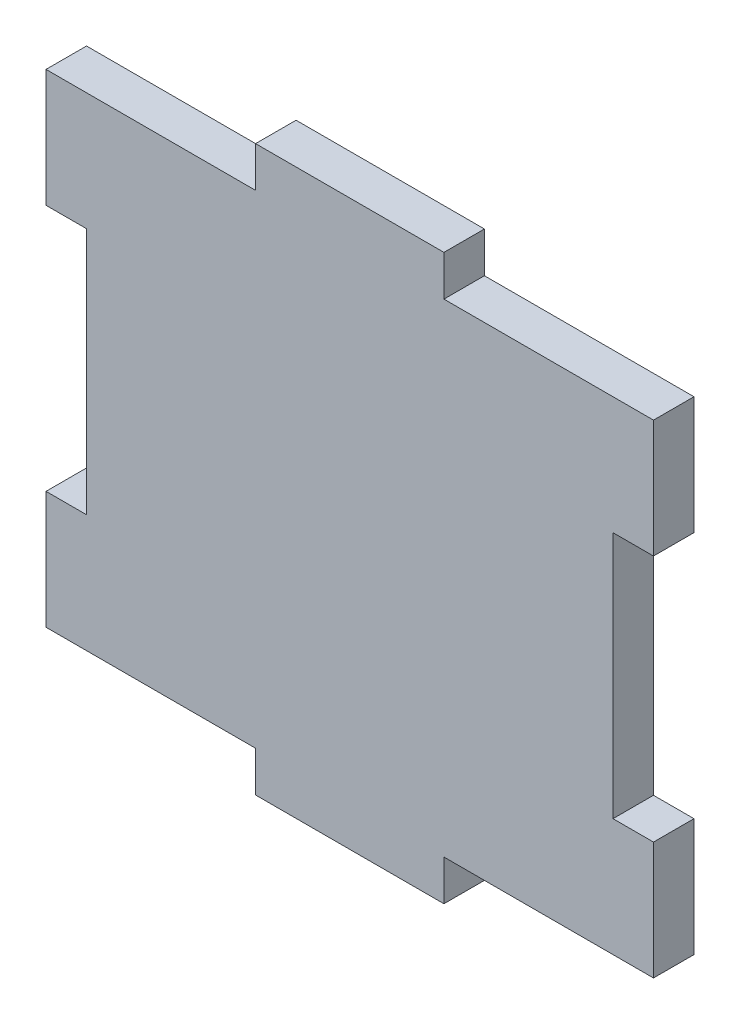
ISO-10303-21;
HEADER;
FILE_DESCRIPTION(('STEP AP214'),'2;1');
FILE_NAME('part.step','',(''),(''),'','','');
FILE_SCHEMA(('AUTOMOTIVE_DESIGN { 1 0 10303 214 1 1 1 1 }'));
ENDSEC;
DATA;
#1=APPLICATION_CONTEXT('core data for automotive mechanical design processes');
#2=APPLICATION_PROTOCOL_DEFINITION('international standard','automotive_design',2000,#1);
#3=PRODUCT_CONTEXT('',#1,'mechanical');
#4=PRODUCT('Part','Part','',(#3));
#5=PRODUCT_RELATED_PRODUCT_CATEGORY('part','',(#4));
#6=PRODUCT_DEFINITION_FORMATION('','',#4);
#7=PRODUCT_DEFINITION_CONTEXT('part definition',#1,'design');
#8=PRODUCT_DEFINITION('design','',#6,#7);
#9=PRODUCT_DEFINITION_SHAPE('','',#8);
#10=(LENGTH_UNIT() NAMED_UNIT(*) SI_UNIT(.MILLI.,.METRE.));
#11=(NAMED_UNIT(*) PLANE_ANGLE_UNIT() SI_UNIT($,.RADIAN.));
#12=(NAMED_UNIT(*) SI_UNIT($,.STERADIAN.) SOLID_ANGLE_UNIT());
#13=UNCERTAINTY_MEASURE_WITH_UNIT(LENGTH_MEASURE(1.E-05),#10,'distance_accuracy_value','');
#14=(GEOMETRIC_REPRESENTATION_CONTEXT(3) GLOBAL_UNCERTAINTY_ASSIGNED_CONTEXT((#13)) GLOBAL_UNIT_ASSIGNED_CONTEXT((#10,
#11,#12)) REPRESENTATION_CONTEXT('',''));
#15=CARTESIAN_POINT('',(0.,0.,0.));
#16=DIRECTION('',(0.,0.,1.));
#17=DIRECTION('',(1.,0.,0.));
#18=AXIS2_PLACEMENT_3D('',#15,#16,#17);
#19=CARTESIAN_POINT('',(-40.9575,-32.5755,5.461));
#20=DIRECTION('',(0.,1.,0.));
#21=DIRECTION('',(0.,0.,1.));
#22=AXIS2_PLACEMENT_3D('',#19,#20,#21);
#23=PLANE('',#22);
#24=DIRECTION('',(0.,0.,-1.));
#25=VECTOR('',#24,1.);
#26=CARTESIAN_POINT('',(-12.7,-32.5755,31.4414257278436));
#27=LINE('',#26,#25);
#28=CARTESIAN_POINT('',(-12.7,-32.5755,5.461));
#29=VERTEX_POINT('',#28);
#30=CARTESIAN_POINT('',(-12.7,-32.5755,0.));
#31=VERTEX_POINT('',#30);
#32=EDGE_CURVE('E184',#29,#31,#27,.T.);
#33=ORIENTED_EDGE('',*,*,#32,.F.);
#34=DIRECTION('',(1.,0.,0.));
#35=VECTOR('',#34,1.);
#36=CARTESIAN_POINT('',(-40.9575,-32.5755,5.461));
#37=LINE('',#36,#35);
#38=CARTESIAN_POINT('',(-40.9575,-32.5755,5.461));
#39=VERTEX_POINT('',#38);
#40=EDGE_CURVE('E181',#39,#29,#37,.T.);
#41=ORIENTED_EDGE('',*,*,#40,.F.);
#42=DIRECTION('',(0.,0.,-1.));
#43=VECTOR('',#42,1.);
#44=CARTESIAN_POINT('',(-40.9575,-32.5755,5.461));
#45=LINE('',#44,#43);
#46=CARTESIAN_POINT('',(-40.9575,-32.5755,0.));
#47=VERTEX_POINT('',#46);
#48=EDGE_CURVE('E318',#39,#47,#45,.T.);
#49=ORIENTED_EDGE('',*,*,#48,.T.);
#50=DIRECTION('',(1.,0.,0.));
#51=VECTOR('',#50,1.);
#52=CARTESIAN_POINT('',(-40.9575,-32.5755,0.));
#53=LINE('',#52,#51);
#54=EDGE_CURVE('E313',#47,#31,#53,.T.);
#55=ORIENTED_EDGE('',*,*,#54,.T.);
#56=EDGE_LOOP('',(#33,#41,#49,#55));
#57=FACE_BOUND('',#56,.T.);
#58=ADVANCED_FACE('F35',(#57),#23,.F.);
#59=CARTESIAN_POINT('',(-40.9575,32.5755,5.461));
#60=DIRECTION('',(0.,-1.,0.));
#61=DIRECTION('',(0.,0.,-1.));
#62=AXIS2_PLACEMENT_3D('',#59,#60,#61);
#63=PLANE('',#62);
#64=DIRECTION('',(0.,0.,-1.));
#65=VECTOR('',#64,1.);
#66=CARTESIAN_POINT('',(12.7,32.5755,31.4414257278436));
#67=LINE('',#66,#65);
#68=CARTESIAN_POINT('',(12.7,32.5755,5.461));
#69=VERTEX_POINT('',#68);
#70=CARTESIAN_POINT('',(12.7,32.5755,0.));
#71=VERTEX_POINT('',#70);
#72=EDGE_CURVE('E220',#69,#71,#67,.T.);
#73=ORIENTED_EDGE('',*,*,#72,.F.);
#74=DIRECTION('',(-1.,0.,0.));
#75=VECTOR('',#74,1.);
#76=CARTESIAN_POINT('',(-40.9575,32.5755,5.461));
#77=LINE('',#76,#75);
#78=CARTESIAN_POINT('',(40.9575,32.5755,5.461));
#79=VERTEX_POINT('',#78);
#80=EDGE_CURVE('E291',#79,#69,#77,.T.);
#81=ORIENTED_EDGE('',*,*,#80,.F.);
#82=DIRECTION('',(0.,0.,-1.));
#83=VECTOR('',#82,1.);
#84=CARTESIAN_POINT('',(40.9575,32.5755,5.461));
#85=LINE('',#84,#83);
#86=CARTESIAN_POINT('',(40.9575,32.5755,0.));
#87=VERTEX_POINT('',#86);
#88=EDGE_CURVE('E11',#79,#87,#85,.T.);
#89=ORIENTED_EDGE('',*,*,#88,.T.);
#90=DIRECTION('',(-1.,0.,0.));
#91=VECTOR('',#90,1.);
#92=CARTESIAN_POINT('',(-40.9575,32.5755,0.));
#93=LINE('',#92,#91);
#94=EDGE_CURVE('E305',#87,#71,#93,.T.);
#95=ORIENTED_EDGE('',*,*,#94,.T.);
#96=EDGE_LOOP('',(#73,#81,#89,#95));
#97=FACE_BOUND('',#96,.T.);
#98=ADVANCED_FACE('F349',(#97),#63,.F.);
#99=CARTESIAN_POINT('',(40.9575,32.5755,5.461));
#100=DIRECTION('',(-1.,0.,0.));
#101=DIRECTION('',(0.,-1.,0.));
#102=AXIS2_PLACEMENT_3D('',#99,#100,#101);
#103=PLANE('',#102);
#104=DIRECTION('',(0.,1.,0.));
#105=VECTOR('',#104,1.);
#106=CARTESIAN_POINT('',(40.9575,32.5755,0.));
#107=LINE('',#106,#105);
#108=CARTESIAN_POINT('',(40.9575,-32.5755,0.));
#109=VERTEX_POINT('',#108);
#110=CARTESIAN_POINT('',(40.9575,-16.7005,0.));
#111=VERTEX_POINT('',#110);
#112=EDGE_CURVE('E301',#109,#111,#107,.T.);
#113=ORIENTED_EDGE('',*,*,#112,.T.);
#114=DIRECTION('',(0.,0.,1.));
#115=VECTOR('',#114,1.);
#116=CARTESIAN_POINT('',(40.9575,-16.7005,0.));
#117=LINE('',#116,#115);
#118=CARTESIAN_POINT('',(40.9575,-16.7005,5.461));
#119=VERTEX_POINT('',#118);
#120=EDGE_CURVE('E249',#111,#119,#117,.T.);
#121=ORIENTED_EDGE('',*,*,#120,.T.);
#122=DIRECTION('',(0.,1.,0.));
#123=VECTOR('',#122,1.);
#124=CARTESIAN_POINT('',(40.9575,32.5755,5.461));
#125=LINE('',#124,#123);
#126=CARTESIAN_POINT('',(40.9575,-32.5755,5.461));
#127=VERTEX_POINT('',#126);
#128=EDGE_CURVE('E286',#127,#119,#125,.T.);
#129=ORIENTED_EDGE('',*,*,#128,.F.);
#130=DIRECTION('',(0.,0.,-1.));
#131=VECTOR('',#130,1.);
#132=CARTESIAN_POINT('',(40.9575,-32.5755,5.461));
#133=LINE('',#132,#131);
#134=EDGE_CURVE('E300',#127,#109,#133,.T.);
#135=ORIENTED_EDGE('',*,*,#134,.T.);
#136=EDGE_LOOP('',(#113,#121,#129,#135));
#137=FACE_BOUND('',#136,.T.);
#138=ADVANCED_FACE('F369',(#137),#103,.F.);
#139=CARTESIAN_POINT('',(-40.9575,32.5755,5.461));
#140=DIRECTION('',(1.,0.,0.));
#141=DIRECTION('',(0.,1.,0.));
#142=AXIS2_PLACEMENT_3D('',#139,#140,#141);
#143=PLANE('',#142);
#144=DIRECTION('',(0.,-1.,0.));
#145=VECTOR('',#144,1.);
#146=CARTESIAN_POINT('',(-40.9575,32.5755,0.));
#147=LINE('',#146,#145);
#148=CARTESIAN_POINT('',(-40.9575,32.5755,0.));
#149=VERTEX_POINT('',#148);
#150=CARTESIAN_POINT('',(-40.9575,16.7005,0.));
#151=VERTEX_POINT('',#150);
#152=EDGE_CURVE('E309',#149,#151,#147,.T.);
#153=ORIENTED_EDGE('',*,*,#152,.T.);
#154=DIRECTION('',(0.,0.,1.));
#155=VECTOR('',#154,1.);
#156=CARTESIAN_POINT('',(-40.9575,16.7005,0.));
#157=LINE('',#156,#155);
#158=CARTESIAN_POINT('',(-40.9575,16.7005,5.461));
#159=VERTEX_POINT('',#158);
#160=EDGE_CURVE('E253',#151,#159,#157,.T.);
#161=ORIENTED_EDGE('',*,*,#160,.T.);
#162=DIRECTION('',(0.,-1.,0.));
#163=VECTOR('',#162,1.);
#164=CARTESIAN_POINT('',(-40.9575,32.5755,5.461));
#165=LINE('',#164,#163);
#166=CARTESIAN_POINT('',(-40.9575,32.5755,5.461));
#167=VERTEX_POINT('',#166);
#168=EDGE_CURVE('E295',#167,#159,#165,.T.);
#169=ORIENTED_EDGE('',*,*,#168,.F.);
#170=DIRECTION('',(0.,0.,-1.));
#171=VECTOR('',#170,1.);
#172=CARTESIAN_POINT('',(-40.9575,32.5755,5.461));
#173=LINE('',#172,#171);
#174=EDGE_CURVE('E43',#167,#149,#173,.T.);
#175=ORIENTED_EDGE('',*,*,#174,.T.);
#176=EDGE_LOOP('',(#153,#161,#169,#175));
#177=FACE_BOUND('',#176,.T.);
#178=ADVANCED_FACE('F325',(#177),#143,.F.);
#179=CARTESIAN_POINT('',(40.9575,16.7005,5.461));
#180=VERTEX_POINT('',#179);
#181=EDGE_CURVE('E290',#180,#79,#125,.T.);
#182=ORIENTED_EDGE('',*,*,#181,.F.);
#183=DIRECTION('',(0.,0.,1.));
#184=VECTOR('',#183,1.);
#185=CARTESIAN_POINT('',(40.9575,16.7005,0.));
#186=LINE('',#185,#184);
#187=CARTESIAN_POINT('',(40.9575,16.7005,0.));
#188=VERTEX_POINT('',#187);
#189=EDGE_CURVE('E272',#188,#180,#186,.T.);
#190=ORIENTED_EDGE('',*,*,#189,.F.);
#191=EDGE_CURVE('E256',#188,#87,#107,.T.);
#192=ORIENTED_EDGE('',*,*,#191,.T.);
#193=ORIENTED_EDGE('',*,*,#88,.F.);
#194=EDGE_LOOP('',(#182,#190,#192,#193));
#195=FACE_BOUND('',#194,.T.);
#196=ADVANCED_FACE('F37',(#195),#103,.F.);
#197=CARTESIAN_POINT('',(-12.7,32.5755,5.461));
#198=VERTEX_POINT('',#197);
#199=EDGE_CURVE('E289',#198,#167,#77,.T.);
#200=ORIENTED_EDGE('',*,*,#199,.F.);
#201=DIRECTION('',(0.,0.,-1.));
#202=VECTOR('',#201,1.);
#203=CARTESIAN_POINT('',(-12.7,32.5755,31.4414257278436));
#204=LINE('',#203,#202);
#205=CARTESIAN_POINT('',(-12.7,32.5755,0.));
#206=VERTEX_POINT('',#205);
#207=EDGE_CURVE('E214',#198,#206,#204,.T.);
#208=ORIENTED_EDGE('',*,*,#207,.T.);
#209=EDGE_CURVE('E304',#206,#149,#93,.T.);
#210=ORIENTED_EDGE('',*,*,#209,.T.);
#211=ORIENTED_EDGE('',*,*,#174,.F.);
#212=EDGE_LOOP('',(#200,#208,#210,#211));
#213=FACE_BOUND('',#212,.T.);
#214=ADVANCED_FACE('F335',(#213),#63,.F.);
#215=CARTESIAN_POINT('',(-40.9575,-16.7005,5.461));
#216=VERTEX_POINT('',#215);
#217=EDGE_CURVE('E294',#216,#39,#165,.T.);
#218=ORIENTED_EDGE('',*,*,#217,.F.);
#219=DIRECTION('',(0.,0.,1.));
#220=VECTOR('',#219,1.);
#221=CARTESIAN_POINT('',(-40.9575,-16.7005,0.));
#222=LINE('',#221,#220);
#223=CARTESIAN_POINT('',(-40.9575,-16.7005,0.));
#224=VERTEX_POINT('',#223);
#225=EDGE_CURVE('E244',#224,#216,#222,.T.);
#226=ORIENTED_EDGE('',*,*,#225,.F.);
#227=EDGE_CURVE('E308',#224,#47,#147,.T.);
#228=ORIENTED_EDGE('',*,*,#227,.T.);
#229=ORIENTED_EDGE('',*,*,#48,.F.);
#230=EDGE_LOOP('',(#218,#226,#228,#229));
#231=FACE_BOUND('',#230,.T.);
#232=ADVANCED_FACE('F381',(#231),#143,.F.);
#233=CARTESIAN_POINT('',(12.7,-32.5755,5.461));
#234=VERTEX_POINT('',#233);
#235=EDGE_CURVE('E298',#234,#127,#37,.T.);
#236=ORIENTED_EDGE('',*,*,#235,.F.);
#237=DIRECTION('',(0.,0.,-1.));
#238=VECTOR('',#237,1.);
#239=CARTESIAN_POINT('',(12.7,-32.5755,31.4414257278436));
#240=LINE('',#239,#238);
#241=CARTESIAN_POINT('',(12.7,-32.5755,0.));
#242=VERTEX_POINT('',#241);
#243=EDGE_CURVE('E205',#234,#242,#240,.T.);
#244=ORIENTED_EDGE('',*,*,#243,.T.);
#245=EDGE_CURVE('E312',#242,#109,#53,.T.);
#246=ORIENTED_EDGE('',*,*,#245,.T.);
#247=ORIENTED_EDGE('',*,*,#134,.F.);
#248=EDGE_LOOP('',(#236,#244,#246,#247));
#249=FACE_BOUND('',#248,.T.);
#250=ADVANCED_FACE('F374',(#249),#23,.F.);
#251=CARTESIAN_POINT('',(0.,0.,5.461));
#252=DIRECTION('',(0.,0.,1.));
#253=DIRECTION('',(1.,0.,0.));
#254=AXIS2_PLACEMENT_3D('',#251,#252,#253);
#255=PLANE('',#254);
#256=DIRECTION('',(-1.,0.,0.));
#257=VECTOR('',#256,1.);
#258=CARTESIAN_POINT('',(-35.4965,16.7005,5.461));
#259=LINE('',#258,#257);
#260=CARTESIAN_POINT('',(-35.4965,16.7005,5.461));
#261=VERTEX_POINT('',#260);
#262=EDGE_CURVE('E238',#261,#159,#259,.T.);
#263=ORIENTED_EDGE('',*,*,#262,.F.);
#264=DIRECTION('',(0.,1.,0.));
#265=VECTOR('',#264,1.);
#266=CARTESIAN_POINT('',(-35.4965,16.7005,5.461));
#267=LINE('',#266,#265);
#268=CARTESIAN_POINT('',(-35.4965,-16.7005,5.461));
#269=VERTEX_POINT('',#268);
#270=EDGE_CURVE('E248',#269,#261,#267,.T.);
#271=ORIENTED_EDGE('',*,*,#270,.F.);
#272=DIRECTION('',(1.,0.,0.));
#273=VECTOR('',#272,1.);
#274=CARTESIAN_POINT('',(-35.4965,-16.7005,5.461));
#275=LINE('',#274,#273);
#276=EDGE_CURVE('E245',#216,#269,#275,.T.);
#277=ORIENTED_EDGE('',*,*,#276,.F.);
#278=ORIENTED_EDGE('',*,*,#217,.T.);
#279=ORIENTED_EDGE('',*,*,#40,.T.);
#280=DIRECTION('',(0.,1.,0.));
#281=VECTOR('',#280,1.);
#282=CARTESIAN_POINT('',(-12.7,-38.0365,5.461));
#283=LINE('',#282,#281);
#284=CARTESIAN_POINT('',(-12.7,-38.0365,5.461));
#285=VERTEX_POINT('',#284);
#286=EDGE_CURVE('E173',#285,#29,#283,.T.);
#287=ORIENTED_EDGE('',*,*,#286,.F.);
#288=DIRECTION('',(-1.,0.,0.));
#289=VECTOR('',#288,1.);
#290=CARTESIAN_POINT('',(-12.7,-38.0365,5.461));
#291=LINE('',#290,#289);
#292=CARTESIAN_POINT('',(12.7,-38.0365,5.461));
#293=VERTEX_POINT('',#292);
#294=EDGE_CURVE('E178',#293,#285,#291,.T.);
#295=ORIENTED_EDGE('',*,*,#294,.F.);
#296=DIRECTION('',(0.,-1.,0.));
#297=VECTOR('',#296,1.);
#298=CARTESIAN_POINT('',(12.7,-38.0365,5.461));
#299=LINE('',#298,#297);
#300=EDGE_CURVE('E204',#234,#293,#299,.T.);
#301=ORIENTED_EDGE('',*,*,#300,.F.);
#302=ORIENTED_EDGE('',*,*,#235,.T.);
#303=ORIENTED_EDGE('',*,*,#128,.T.);
#304=DIRECTION('',(1.,0.,0.));
#305=VECTOR('',#304,1.);
#306=CARTESIAN_POINT('',(35.4965,-16.7005,5.461));
#307=LINE('',#306,#305);
#308=CARTESIAN_POINT('',(35.4965,-16.7005,5.461));
#309=VERTEX_POINT('',#308);
#310=EDGE_CURVE('E266',#309,#119,#307,.T.);
#311=ORIENTED_EDGE('',*,*,#310,.F.);
#312=DIRECTION('',(0.,-1.,0.));
#313=VECTOR('',#312,1.);
#314=CARTESIAN_POINT('',(35.4965,16.7005,5.461));
#315=LINE('',#314,#313);
#316=CARTESIAN_POINT('',(35.4965,16.7005,5.461));
#317=VERTEX_POINT('',#316);
#318=EDGE_CURVE('E275',#317,#309,#315,.T.);
#319=ORIENTED_EDGE('',*,*,#318,.F.);
#320=DIRECTION('',(-1.,0.,0.));
#321=VECTOR('',#320,1.);
#322=CARTESIAN_POINT('',(35.4965,16.7005,5.461));
#323=LINE('',#322,#321);
#324=EDGE_CURVE('E233',#180,#317,#323,.T.);
#325=ORIENTED_EDGE('',*,*,#324,.F.);
#326=ORIENTED_EDGE('',*,*,#181,.T.);
#327=ORIENTED_EDGE('',*,*,#80,.T.);
#328=DIRECTION('',(0.,-1.,0.));
#329=VECTOR('',#328,1.);
#330=CARTESIAN_POINT('',(12.7,38.0365,5.461));
#331=LINE('',#330,#329);
#332=CARTESIAN_POINT('',(12.7,38.0365,5.461));
#333=VERTEX_POINT('',#332);
#334=EDGE_CURVE('E218',#333,#69,#331,.T.);
#335=ORIENTED_EDGE('',*,*,#334,.F.);
#336=DIRECTION('',(1.,0.,0.));
#337=VECTOR('',#336,1.);
#338=CARTESIAN_POINT('',(-12.7,38.0365,5.461));
#339=LINE('',#338,#337);
#340=CARTESIAN_POINT('',(-12.7,38.0365,5.461));
#341=VERTEX_POINT('',#340);
#342=EDGE_CURVE('E222',#341,#333,#339,.T.);
#343=ORIENTED_EDGE('',*,*,#342,.F.);
#344=DIRECTION('',(0.,1.,0.));
#345=VECTOR('',#344,1.);
#346=CARTESIAN_POINT('',(-12.7,38.0365,5.461));
#347=LINE('',#346,#345);
#348=EDGE_CURVE('E226',#198,#341,#347,.T.);
#349=ORIENTED_EDGE('',*,*,#348,.F.);
#350=ORIENTED_EDGE('',*,*,#199,.T.);
#351=ORIENTED_EDGE('',*,*,#168,.T.);
#352=EDGE_LOOP('',(#263,#271,#277,#278,#279,#287,#295,#301,#302,#303,#311,#319,#325,#326,#327,
#335,#343,#349,#350,#351));
#353=FACE_BOUND('',#352,.T.);
#354=ADVANCED_FACE('F176',(#353),#255,.T.);
#355=CARTESIAN_POINT('',(0.,0.,0.));
#356=DIRECTION('',(0.,0.,1.));
#357=DIRECTION('',(1.,0.,0.));
#358=AXIS2_PLACEMENT_3D('',#355,#356,#357);
#359=PLANE('',#358);
#360=DIRECTION('',(0.,1.,0.));
#361=VECTOR('',#360,1.);
#362=CARTESIAN_POINT('',(-35.4965,16.7005,0.));
#363=LINE('',#362,#361);
#364=CARTESIAN_POINT('',(-35.4965,-16.7005,0.));
#365=VERTEX_POINT('',#364);
#366=CARTESIAN_POINT('',(-35.4965,16.7005,0.));
#367=VERTEX_POINT('',#366);
#368=EDGE_CURVE('E237',#365,#367,#363,.T.);
#369=ORIENTED_EDGE('',*,*,#368,.T.);
#370=DIRECTION('',(-1.,0.,0.));
#371=VECTOR('',#370,1.);
#372=CARTESIAN_POINT('',(-35.4965,16.7005,0.));
#373=LINE('',#372,#371);
#374=EDGE_CURVE('E241',#367,#151,#373,.T.);
#375=ORIENTED_EDGE('',*,*,#374,.T.);
#376=ORIENTED_EDGE('',*,*,#152,.F.);
#377=ORIENTED_EDGE('',*,*,#209,.F.);
#378=DIRECTION('',(0.,1.,0.));
#379=VECTOR('',#378,1.);
#380=CARTESIAN_POINT('',(-12.7,38.0365,0.));
#381=LINE('',#380,#379);
#382=CARTESIAN_POINT('',(-12.7,38.0365,0.));
#383=VERTEX_POINT('',#382);
#384=EDGE_CURVE('E58',#206,#383,#381,.T.);
#385=ORIENTED_EDGE('',*,*,#384,.T.);
#386=DIRECTION('',(1.,0.,0.));
#387=VECTOR('',#386,1.);
#388=CARTESIAN_POINT('',(-12.7,38.0365,0.));
#389=LINE('',#388,#387);
#390=CARTESIAN_POINT('',(12.7,38.0365,0.));
#391=VERTEX_POINT('',#390);
#392=EDGE_CURVE('E211',#383,#391,#389,.T.);
#393=ORIENTED_EDGE('',*,*,#392,.T.);
#394=DIRECTION('',(0.,-1.,0.));
#395=VECTOR('',#394,1.);
#396=CARTESIAN_POINT('',(12.7,38.0365,0.));
#397=LINE('',#396,#395);
#398=EDGE_CURVE('E210',#391,#71,#397,.T.);
#399=ORIENTED_EDGE('',*,*,#398,.T.);
#400=ORIENTED_EDGE('',*,*,#94,.F.);
#401=ORIENTED_EDGE('',*,*,#191,.F.);
#402=DIRECTION('',(-1.,0.,0.));
#403=VECTOR('',#402,1.);
#404=CARTESIAN_POINT('',(35.4965,16.7005,0.));
#405=LINE('',#404,#403);
#406=CARTESIAN_POINT('',(35.4965,16.7005,0.));
#407=VERTEX_POINT('',#406);
#408=EDGE_CURVE('E262',#188,#407,#405,.T.);
#409=ORIENTED_EDGE('',*,*,#408,.T.);
#410=DIRECTION('',(0.,-1.,0.));
#411=VECTOR('',#410,1.);
#412=CARTESIAN_POINT('',(35.4965,16.7005,0.));
#413=LINE('',#412,#411);
#414=CARTESIAN_POINT('',(35.4965,-16.7005,0.));
#415=VERTEX_POINT('',#414);
#416=EDGE_CURVE('E265',#407,#415,#413,.T.);
#417=ORIENTED_EDGE('',*,*,#416,.T.);
#418=DIRECTION('',(1.,0.,0.));
#419=VECTOR('',#418,1.);
#420=CARTESIAN_POINT('',(35.4965,-16.7005,0.));
#421=LINE('',#420,#419);
#422=EDGE_CURVE('E269',#415,#111,#421,.T.);
#423=ORIENTED_EDGE('',*,*,#422,.T.);
#424=ORIENTED_EDGE('',*,*,#112,.F.);
#425=ORIENTED_EDGE('',*,*,#245,.F.);
#426=DIRECTION('',(0.,-1.,0.));
#427=VECTOR('',#426,1.);
#428=CARTESIAN_POINT('',(12.7,-38.0365,0.));
#429=LINE('',#428,#427);
#430=CARTESIAN_POINT('',(12.7,-38.0365,0.));
#431=VERTEX_POINT('',#430);
#432=EDGE_CURVE('E50',#242,#431,#429,.T.);
#433=ORIENTED_EDGE('',*,*,#432,.T.);
#434=DIRECTION('',(-1.,0.,0.));
#435=VECTOR('',#434,1.);
#436=CARTESIAN_POINT('',(-12.7,-38.0365,0.));
#437=LINE('',#436,#435);
#438=CARTESIAN_POINT('',(-12.7,-38.0365,0.));
#439=VERTEX_POINT('',#438);
#440=EDGE_CURVE('E199',#431,#439,#437,.T.);
#441=ORIENTED_EDGE('',*,*,#440,.T.);
#442=DIRECTION('',(0.,1.,0.));
#443=VECTOR('',#442,1.);
#444=CARTESIAN_POINT('',(-12.7,-38.0365,0.));
#445=LINE('',#444,#443);
#446=EDGE_CURVE('E190',#439,#31,#445,.T.);
#447=ORIENTED_EDGE('',*,*,#446,.T.);
#448=ORIENTED_EDGE('',*,*,#54,.F.);
#449=ORIENTED_EDGE('',*,*,#227,.F.);
#450=DIRECTION('',(1.,0.,0.));
#451=VECTOR('',#450,1.);
#452=CARTESIAN_POINT('',(-35.4965,-16.7005,0.));
#453=LINE('',#452,#451);
#454=EDGE_CURVE('E234',#224,#365,#453,.T.);
#455=ORIENTED_EDGE('',*,*,#454,.T.);
#456=EDGE_LOOP('',(#369,#375,#376,#377,#385,#393,#399,#400,#401,#409,#417,#423,#424,#425,#433,
#441,#447,#448,#449,#455));
#457=FACE_BOUND('',#456,.T.);
#458=ADVANCED_FACE('F330',(#457),#359,.F.);
#459=CARTESIAN_POINT('',(35.4965,-16.7005,0.));
#460=DIRECTION('',(0.,-1.,0.));
#461=DIRECTION('',(0.,0.,-1.));
#462=AXIS2_PLACEMENT_3D('',#459,#460,#461);
#463=PLANE('',#462);
#464=ORIENTED_EDGE('',*,*,#310,.T.);
#465=ORIENTED_EDGE('',*,*,#120,.F.);
#466=ORIENTED_EDGE('',*,*,#422,.F.);
#467=DIRECTION('',(0.,0.,1.));
#468=VECTOR('',#467,1.);
#469=CARTESIAN_POINT('',(35.4965,-16.7005,0.));
#470=LINE('',#469,#468);
#471=EDGE_CURVE('E281',#415,#309,#470,.T.);
#472=ORIENTED_EDGE('',*,*,#471,.T.);
#473=EDGE_LOOP('',(#464,#465,#466,#472));
#474=FACE_BOUND('',#473,.T.);
#475=ADVANCED_FACE('F365',(#474),#463,.F.);
#476=CARTESIAN_POINT('',(35.4965,16.7005,0.));
#477=DIRECTION('',(-1.,0.,0.));
#478=DIRECTION('',(0.,0.,1.));
#479=AXIS2_PLACEMENT_3D('',#476,#477,#478);
#480=PLANE('',#479);
#481=ORIENTED_EDGE('',*,*,#318,.T.);
#482=ORIENTED_EDGE('',*,*,#471,.F.);
#483=ORIENTED_EDGE('',*,*,#416,.F.);
#484=DIRECTION('',(0.,0.,1.));
#485=VECTOR('',#484,1.);
#486=CARTESIAN_POINT('',(35.4965,16.7005,0.));
#487=LINE('',#486,#485);
#488=EDGE_CURVE('E283',#407,#317,#487,.T.);
#489=ORIENTED_EDGE('',*,*,#488,.T.);
#490=EDGE_LOOP('',(#481,#482,#483,#489));
#491=FACE_BOUND('',#490,.T.);
#492=ADVANCED_FACE('F361',(#491),#480,.F.);
#493=CARTESIAN_POINT('',(35.4965,16.7005,0.));
#494=DIRECTION('',(0.,1.,0.));
#495=DIRECTION('',(0.,0.,1.));
#496=AXIS2_PLACEMENT_3D('',#493,#494,#495);
#497=PLANE('',#496);
#498=ORIENTED_EDGE('',*,*,#324,.T.);
#499=ORIENTED_EDGE('',*,*,#488,.F.);
#500=ORIENTED_EDGE('',*,*,#408,.F.);
#501=ORIENTED_EDGE('',*,*,#189,.T.);
#502=EDGE_LOOP('',(#498,#499,#500,#501));
#503=FACE_BOUND('',#502,.T.);
#504=ADVANCED_FACE('F357',(#503),#497,.F.);
#505=CARTESIAN_POINT('',(-35.4965,16.7005,0.));
#506=DIRECTION('',(0.,1.,0.));
#507=DIRECTION('',(0.,0.,1.));
#508=AXIS2_PLACEMENT_3D('',#505,#506,#507);
#509=PLANE('',#508);
#510=ORIENTED_EDGE('',*,*,#262,.T.);
#511=ORIENTED_EDGE('',*,*,#160,.F.);
#512=ORIENTED_EDGE('',*,*,#374,.F.);
#513=DIRECTION('',(0.,0.,1.));
#514=VECTOR('',#513,1.);
#515=CARTESIAN_POINT('',(-35.4965,16.7005,0.));
#516=LINE('',#515,#514);
#517=EDGE_CURVE('E257',#367,#261,#516,.T.);
#518=ORIENTED_EDGE('',*,*,#517,.T.);
#519=EDGE_LOOP('',(#510,#511,#512,#518));
#520=FACE_BOUND('',#519,.T.);
#521=ADVANCED_FACE('F333',(#520),#509,.F.);
#522=CARTESIAN_POINT('',(-35.4965,16.7005,0.));
#523=DIRECTION('',(1.,0.,0.));
#524=DIRECTION('',(0.,0.,-1.));
#525=AXIS2_PLACEMENT_3D('',#522,#523,#524);
#526=PLANE('',#525);
#527=ORIENTED_EDGE('',*,*,#270,.T.);
#528=ORIENTED_EDGE('',*,*,#517,.F.);
#529=ORIENTED_EDGE('',*,*,#368,.F.);
#530=DIRECTION('',(0.,0.,1.));
#531=VECTOR('',#530,1.);
#532=CARTESIAN_POINT('',(-35.4965,-16.7005,0.));
#533=LINE('',#532,#531);
#534=EDGE_CURVE('E259',#365,#269,#533,.T.);
#535=ORIENTED_EDGE('',*,*,#534,.T.);
#536=EDGE_LOOP('',(#527,#528,#529,#535));
#537=FACE_BOUND('',#536,.T.);
#538=ADVANCED_FACE('F388',(#537),#526,.F.);
#539=CARTESIAN_POINT('',(-35.4965,-16.7005,0.));
#540=DIRECTION('',(0.,-1.,0.));
#541=DIRECTION('',(0.,0.,-1.));
#542=AXIS2_PLACEMENT_3D('',#539,#540,#541);
#543=PLANE('',#542);
#544=ORIENTED_EDGE('',*,*,#276,.T.);
#545=ORIENTED_EDGE('',*,*,#534,.F.);
#546=ORIENTED_EDGE('',*,*,#454,.F.);
#547=ORIENTED_EDGE('',*,*,#225,.T.);
#548=EDGE_LOOP('',(#544,#545,#546,#547));
#549=FACE_BOUND('',#548,.T.);
#550=ADVANCED_FACE('F385',(#549),#543,.F.);
#551=CARTESIAN_POINT('',(-12.7,38.0365,31.4414257278436));
#552=DIRECTION('',(-1.,0.,0.));
#553=DIRECTION('',(0.,0.,1.));
#554=AXIS2_PLACEMENT_3D('',#551,#552,#553);
#555=PLANE('',#554);
#556=ORIENTED_EDGE('',*,*,#207,.F.);
#557=ORIENTED_EDGE('',*,*,#348,.T.);
#558=DIRECTION('',(0.,0.,-1.));
#559=VECTOR('',#558,1.);
#560=CARTESIAN_POINT('',(-12.7,38.0365,31.4414257278436));
#561=LINE('',#560,#559);
#562=EDGE_CURVE('E225',#341,#383,#561,.T.);
#563=ORIENTED_EDGE('',*,*,#562,.T.);
#564=ORIENTED_EDGE('',*,*,#384,.F.);
#565=EDGE_LOOP('',(#556,#557,#563,#564));
#566=FACE_BOUND('',#565,.T.);
#567=ADVANCED_FACE('F336',(#566),#555,.T.);
#568=CARTESIAN_POINT('',(-12.7,38.0365,31.4414257278436));
#569=DIRECTION('',(0.,1.,0.));
#570=DIRECTION('',(0.,0.,1.));
#571=AXIS2_PLACEMENT_3D('',#568,#569,#570);
#572=PLANE('',#571);
#573=ORIENTED_EDGE('',*,*,#562,.F.);
#574=ORIENTED_EDGE('',*,*,#342,.T.);
#575=DIRECTION('',(0.,0.,-1.));
#576=VECTOR('',#575,1.);
#577=CARTESIAN_POINT('',(12.7,38.0365,31.4414257278436));
#578=LINE('',#577,#576);
#579=EDGE_CURVE('E221',#333,#391,#578,.T.);
#580=ORIENTED_EDGE('',*,*,#579,.T.);
#581=ORIENTED_EDGE('',*,*,#392,.F.);
#582=EDGE_LOOP('',(#573,#574,#580,#581));
#583=FACE_BOUND('',#582,.T.);
#584=ADVANCED_FACE('F340',(#583),#572,.T.);
#585=CARTESIAN_POINT('',(12.7,38.0365,31.4414257278436));
#586=DIRECTION('',(1.,0.,0.));
#587=DIRECTION('',(0.,0.,-1.));
#588=AXIS2_PLACEMENT_3D('',#585,#586,#587);
#589=PLANE('',#588);
#590=ORIENTED_EDGE('',*,*,#579,.F.);
#591=ORIENTED_EDGE('',*,*,#334,.T.);
#592=ORIENTED_EDGE('',*,*,#72,.T.);
#593=ORIENTED_EDGE('',*,*,#398,.F.);
#594=EDGE_LOOP('',(#590,#591,#592,#593));
#595=FACE_BOUND('',#594,.T.);
#596=ADVANCED_FACE('F344',(#595),#589,.T.);
#597=CARTESIAN_POINT('',(-12.7,-38.0365,31.4414257278436));
#598=DIRECTION('',(0.,-1.,0.));
#599=DIRECTION('',(0.,0.,-1.));
#600=AXIS2_PLACEMENT_3D('',#597,#598,#599);
#601=PLANE('',#600);
#602=DIRECTION('',(0.,0.,-1.));
#603=VECTOR('',#602,1.);
#604=CARTESIAN_POINT('',(12.7,-38.0365,31.4414257278436));
#605=LINE('',#604,#603);
#606=EDGE_CURVE('E197',#293,#431,#605,.T.);
#607=ORIENTED_EDGE('',*,*,#606,.F.);
#608=ORIENTED_EDGE('',*,*,#294,.T.);
#609=DIRECTION('',(0.,0.,-1.));
#610=VECTOR('',#609,1.);
#611=CARTESIAN_POINT('',(-12.7,-38.0365,31.4414257278436));
#612=LINE('',#611,#610);
#613=EDGE_CURVE('E185',#285,#439,#612,.T.);
#614=ORIENTED_EDGE('',*,*,#613,.T.);
#615=ORIENTED_EDGE('',*,*,#440,.F.);
#616=EDGE_LOOP('',(#607,#608,#614,#615));
#617=FACE_BOUND('',#616,.T.);
#618=ADVANCED_FACE('F196',(#617),#601,.T.);
#619=CARTESIAN_POINT('',(-12.7,-38.0365,31.4414257278436));
#620=DIRECTION('',(-1.,0.,0.));
#621=DIRECTION('',(0.,0.,1.));
#622=AXIS2_PLACEMENT_3D('',#619,#620,#621);
#623=PLANE('',#622);
#624=ORIENTED_EDGE('',*,*,#613,.F.);
#625=ORIENTED_EDGE('',*,*,#286,.T.);
#626=ORIENTED_EDGE('',*,*,#32,.T.);
#627=ORIENTED_EDGE('',*,*,#446,.F.);
#628=EDGE_LOOP('',(#624,#625,#626,#627));
#629=FACE_BOUND('',#628,.T.);
#630=ADVANCED_FACE('F188',(#629),#623,.T.);
#631=CARTESIAN_POINT('',(12.7,-38.0365,31.4414257278436));
#632=DIRECTION('',(1.,0.,0.));
#633=DIRECTION('',(0.,0.,-1.));
#634=AXIS2_PLACEMENT_3D('',#631,#632,#633);
#635=PLANE('',#634);
#636=ORIENTED_EDGE('',*,*,#243,.F.);
#637=ORIENTED_EDGE('',*,*,#300,.T.);
#638=ORIENTED_EDGE('',*,*,#606,.T.);
#639=ORIENTED_EDGE('',*,*,#432,.F.);
#640=EDGE_LOOP('',(#636,#637,#638,#639));
#641=FACE_BOUND('',#640,.T.);
#642=ADVANCED_FACE('F498',(#641),#635,.T.);
#643=CLOSED_SHELL('',(#58,#98,#138,#178,#196,#214,#232,#250,#354,#458,#475,#492,#504,#521,#538,
#550,#567,#584,#596,#618,#630,#642));
#644=MANIFOLD_SOLID_BREP('B2',#643);
#645=ADVANCED_BREP_SHAPE_REPRESENTATION('',(#18,#644),#14);
#646=SHAPE_DEFINITION_REPRESENTATION(#9,#645);
ENDSEC;
END-ISO-10303-21;
